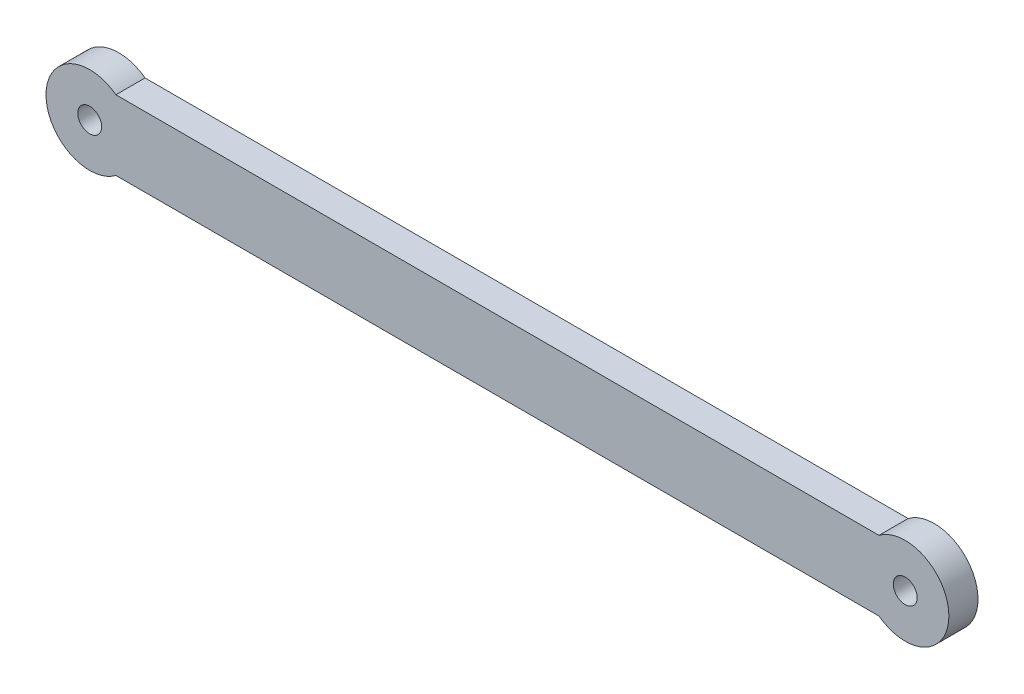
ISO-10303-21;
HEADER;
FILE_DESCRIPTION(('STEP AP214'),'2;1');
FILE_NAME('part.step','',(''),(''),'','','');
FILE_SCHEMA(('AUTOMOTIVE_DESIGN { 1 0 10303 214 1 1 1 1 }'));
ENDSEC;
DATA;
#1=APPLICATION_CONTEXT('core data for automotive mechanical design processes');
#2=APPLICATION_PROTOCOL_DEFINITION('international standard','automotive_design',2000,#1);
#3=PRODUCT_CONTEXT('',#1,'mechanical');
#4=PRODUCT('Part','Part','',(#3));
#5=PRODUCT_RELATED_PRODUCT_CATEGORY('part','',(#4));
#6=PRODUCT_DEFINITION_FORMATION('','',#4);
#7=PRODUCT_DEFINITION_CONTEXT('part definition',#1,'design');
#8=PRODUCT_DEFINITION('design','',#6,#7);
#9=PRODUCT_DEFINITION_SHAPE('','',#8);
#10=(LENGTH_UNIT() NAMED_UNIT(*) SI_UNIT(.MILLI.,.METRE.));
#11=(NAMED_UNIT(*) PLANE_ANGLE_UNIT() SI_UNIT($,.RADIAN.));
#12=(NAMED_UNIT(*) SI_UNIT($,.STERADIAN.) SOLID_ANGLE_UNIT());
#13=UNCERTAINTY_MEASURE_WITH_UNIT(LENGTH_MEASURE(1.E-05),#10,'distance_accuracy_value','');
#14=(GEOMETRIC_REPRESENTATION_CONTEXT(3) GLOBAL_UNCERTAINTY_ASSIGNED_CONTEXT((#13)) GLOBAL_UNIT_ASSIGNED_CONTEXT((#10,
#11,#12)) REPRESENTATION_CONTEXT('',''));
#15=CARTESIAN_POINT('',(0.,0.,0.));
#16=DIRECTION('',(0.,0.,1.));
#17=DIRECTION('',(1.,0.,0.));
#18=AXIS2_PLACEMENT_3D('',#15,#16,#17);
#19=CARTESIAN_POINT('',(0.,0.,5.));
#20=DIRECTION('',(0.,0.,1.));
#21=DIRECTION('',(1.,0.,0.));
#22=AXIS2_PLACEMENT_3D('',#19,#20,#21);
#23=PLANE('',#22);
#24=CARTESIAN_POINT('',(0.,0.,5.));
#25=DIRECTION('',(0.,0.,1.));
#26=DIRECTION('',(1.,0.,0.));
#27=AXIS2_PLACEMENT_3D('',#24,#25,#26);
#28=CIRCLE('',#27,2.05);
#29=CARTESIAN_POINT('',(2.05,0.,5.));
#30=VERTEX_POINT('',#29);
#31=EDGE_CURVE('E103',#30,#30,#28,.T.);
#32=ORIENTED_EDGE('',*,*,#31,.F.);
#33=EDGE_LOOP('',(#32));
#34=FACE_BOUND('',#33,.T.);
#35=CARTESIAN_POINT('',(0.,0.,5.));
#36=DIRECTION('',(0.,0.,1.));
#37=DIRECTION('',(1.,0.,0.));
#38=AXIS2_PLACEMENT_3D('',#35,#36,#37);
#39=CIRCLE('',#38,7.5);
#40=CARTESIAN_POINT('',(4.5,6.,5.));
#41=VERTEX_POINT('',#40);
#42=CARTESIAN_POINT('',(4.5,-6.,5.));
#43=VERTEX_POINT('',#42);
#44=EDGE_CURVE('E88',#41,#43,#39,.T.);
#45=ORIENTED_EDGE('',*,*,#44,.T.);
#46=DIRECTION('',(1.,0.,0.));
#47=VECTOR('',#46,1.);
#48=CARTESIAN_POINT('',(4.5,-6.,5.));
#49=LINE('',#48,#47);
#50=CARTESIAN_POINT('',(135.5,-6.,5.));
#51=VERTEX_POINT('',#50);
#52=EDGE_CURVE('E83',#43,#51,#49,.T.);
#53=ORIENTED_EDGE('',*,*,#52,.T.);
#54=CARTESIAN_POINT('',(140.,0.,5.));
#55=DIRECTION('',(0.,0.,1.));
#56=DIRECTION('',(1.,0.,0.));
#57=AXIS2_PLACEMENT_3D('',#54,#55,#56);
#58=CIRCLE('',#57,7.5);
#59=CARTESIAN_POINT('',(135.5,6.,5.));
#60=VERTEX_POINT('',#59);
#61=EDGE_CURVE('E86',#51,#60,#58,.T.);
#62=ORIENTED_EDGE('',*,*,#61,.T.);
#63=DIRECTION('',(-1.,0.,0.));
#64=VECTOR('',#63,1.);
#65=CARTESIAN_POINT('',(4.5,6.,5.));
#66=LINE('',#65,#64);
#67=EDGE_CURVE('E53',#60,#41,#66,.T.);
#68=ORIENTED_EDGE('',*,*,#67,.T.);
#69=EDGE_LOOP('',(#45,#53,#62,#68));
#70=FACE_BOUND('',#69,.T.);
#71=CARTESIAN_POINT('',(140.,0.,5.));
#72=DIRECTION('',(0.,0.,1.));
#73=DIRECTION('',(1.,0.,0.));
#74=AXIS2_PLACEMENT_3D('',#71,#72,#73);
#75=CIRCLE('',#74,2.04999999999999);
#76=CARTESIAN_POINT('',(142.05,0.,5.));
#77=VERTEX_POINT('',#76);
#78=EDGE_CURVE('E118',#77,#77,#75,.T.);
#79=ORIENTED_EDGE('',*,*,#78,.F.);
#80=EDGE_LOOP('',(#79));
#81=FACE_BOUND('',#80,.T.);
#82=ADVANCED_FACE('F36',(#34,#70,#81),#23,.T.);
#83=CARTESIAN_POINT('',(0.,0.,0.));
#84=DIRECTION('',(0.,0.,1.));
#85=DIRECTION('',(1.,0.,0.));
#86=AXIS2_PLACEMENT_3D('',#83,#84,#85);
#87=PLANE('',#86);
#88=CARTESIAN_POINT('',(0.,0.,0.));
#89=DIRECTION('',(0.,0.,1.));
#90=DIRECTION('',(1.,0.,0.));
#91=AXIS2_PLACEMENT_3D('',#88,#89,#90);
#92=CIRCLE('',#91,7.5);
#93=CARTESIAN_POINT('',(4.5,6.,0.));
#94=VERTEX_POINT('',#93);
#95=CARTESIAN_POINT('',(4.5,-6.,0.));
#96=VERTEX_POINT('',#95);
#97=EDGE_CURVE('E100',#94,#96,#92,.T.);
#98=ORIENTED_EDGE('',*,*,#97,.F.);
#99=DIRECTION('',(-1.,0.,0.));
#100=VECTOR('',#99,1.);
#101=CARTESIAN_POINT('',(4.5,6.,0.));
#102=LINE('',#101,#100);
#103=CARTESIAN_POINT('',(135.5,6.,0.));
#104=VERTEX_POINT('',#103);
#105=EDGE_CURVE('E76',#104,#94,#102,.T.);
#106=ORIENTED_EDGE('',*,*,#105,.F.);
#107=CARTESIAN_POINT('',(140.,0.,0.));
#108=DIRECTION('',(0.,0.,1.));
#109=DIRECTION('',(1.,0.,0.));
#110=AXIS2_PLACEMENT_3D('',#107,#108,#109);
#111=CIRCLE('',#110,7.5);
#112=CARTESIAN_POINT('',(135.5,-6.,0.));
#113=VERTEX_POINT('',#112);
#114=EDGE_CURVE('E70',#113,#104,#111,.T.);
#115=ORIENTED_EDGE('',*,*,#114,.F.);
#116=DIRECTION('',(1.,0.,0.));
#117=VECTOR('',#116,1.);
#118=CARTESIAN_POINT('',(4.5,-6.,0.));
#119=LINE('',#118,#117);
#120=EDGE_CURVE('E92',#96,#113,#119,.T.);
#121=ORIENTED_EDGE('',*,*,#120,.F.);
#122=EDGE_LOOP('',(#98,#106,#115,#121));
#123=FACE_BOUND('',#122,.T.);
#124=CARTESIAN_POINT('',(0.,0.,0.));
#125=DIRECTION('',(0.,0.,1.));
#126=DIRECTION('',(1.,0.,0.));
#127=AXIS2_PLACEMENT_3D('',#124,#125,#126);
#128=CIRCLE('',#127,2.05);
#129=CARTESIAN_POINT('',(2.05,0.,0.));
#130=VERTEX_POINT('',#129);
#131=EDGE_CURVE('E115',#130,#130,#128,.T.);
#132=ORIENTED_EDGE('',*,*,#131,.T.);
#133=EDGE_LOOP('',(#132));
#134=FACE_BOUND('',#133,.T.);
#135=CARTESIAN_POINT('',(140.,0.,0.));
#136=DIRECTION('',(0.,0.,1.));
#137=DIRECTION('',(1.,0.,0.));
#138=AXIS2_PLACEMENT_3D('',#135,#136,#137);
#139=CIRCLE('',#138,2.04999999999999);
#140=CARTESIAN_POINT('',(142.05,0.,0.));
#141=VERTEX_POINT('',#140);
#142=EDGE_CURVE('E121',#141,#141,#139,.T.);
#143=ORIENTED_EDGE('',*,*,#142,.T.);
#144=EDGE_LOOP('',(#143));
#145=FACE_BOUND('',#144,.T.);
#146=ADVANCED_FACE('F111',(#123,#134,#145),#87,.F.);
#147=CARTESIAN_POINT('',(0.,0.,5.));
#148=DIRECTION('',(0.,0.,-1.));
#149=DIRECTION('',(-1.,0.,0.));
#150=AXIS2_PLACEMENT_3D('',#147,#148,#149);
#151=CYLINDRICAL_SURFACE('',#150,7.5);
#152=ORIENTED_EDGE('',*,*,#97,.T.);
#153=DIRECTION('',(0.,0.,-1.));
#154=VECTOR('',#153,1.);
#155=CARTESIAN_POINT('',(4.5,-6.,5.));
#156=LINE('',#155,#154);
#157=EDGE_CURVE('E11',#43,#96,#156,.T.);
#158=ORIENTED_EDGE('',*,*,#157,.F.);
#159=ORIENTED_EDGE('',*,*,#44,.F.);
#160=DIRECTION('',(0.,0.,-1.));
#161=VECTOR('',#160,1.);
#162=CARTESIAN_POINT('',(4.5,6.,5.));
#163=LINE('',#162,#161);
#164=EDGE_CURVE('E96',#41,#94,#163,.T.);
#165=ORIENTED_EDGE('',*,*,#164,.T.);
#166=EDGE_LOOP('',(#152,#158,#159,#165));
#167=FACE_BOUND('',#166,.T.);
#168=ADVANCED_FACE('F38',(#167),#151,.T.);
#169=CARTESIAN_POINT('',(4.5,-6.,5.));
#170=DIRECTION('',(0.,1.,0.));
#171=DIRECTION('',(0.,0.,1.));
#172=AXIS2_PLACEMENT_3D('',#169,#170,#171);
#173=PLANE('',#172);
#174=ORIENTED_EDGE('',*,*,#120,.T.);
#175=DIRECTION('',(0.,0.,-1.));
#176=VECTOR('',#175,1.);
#177=CARTESIAN_POINT('',(135.5,-6.,5.));
#178=LINE('',#177,#176);
#179=EDGE_CURVE('E45',#51,#113,#178,.T.);
#180=ORIENTED_EDGE('',*,*,#179,.F.);
#181=ORIENTED_EDGE('',*,*,#52,.F.);
#182=ORIENTED_EDGE('',*,*,#157,.T.);
#183=EDGE_LOOP('',(#174,#180,#181,#182));
#184=FACE_BOUND('',#183,.T.);
#185=ADVANCED_FACE('F91',(#184),#173,.F.);
#186=CARTESIAN_POINT('',(140.,0.,5.));
#187=DIRECTION('',(0.,0.,-1.));
#188=DIRECTION('',(-1.,0.,0.));
#189=AXIS2_PLACEMENT_3D('',#186,#187,#188);
#190=CYLINDRICAL_SURFACE('',#189,7.5);
#191=ORIENTED_EDGE('',*,*,#114,.T.);
#192=DIRECTION('',(0.,0.,-1.));
#193=VECTOR('',#192,1.);
#194=CARTESIAN_POINT('',(135.5,6.,5.));
#195=LINE('',#194,#193);
#196=EDGE_CURVE('E93',#60,#104,#195,.T.);
#197=ORIENTED_EDGE('',*,*,#196,.F.);
#198=ORIENTED_EDGE('',*,*,#61,.F.);
#199=ORIENTED_EDGE('',*,*,#179,.T.);
#200=EDGE_LOOP('',(#191,#197,#198,#199));
#201=FACE_BOUND('',#200,.T.);
#202=ADVANCED_FACE('F94',(#201),#190,.T.);
#203=CARTESIAN_POINT('',(4.5,6.,5.));
#204=DIRECTION('',(0.,-1.,0.));
#205=DIRECTION('',(0.,0.,-1.));
#206=AXIS2_PLACEMENT_3D('',#203,#204,#205);
#207=PLANE('',#206);
#208=ORIENTED_EDGE('',*,*,#105,.T.);
#209=ORIENTED_EDGE('',*,*,#164,.F.);
#210=ORIENTED_EDGE('',*,*,#67,.F.);
#211=ORIENTED_EDGE('',*,*,#196,.T.);
#212=EDGE_LOOP('',(#208,#209,#210,#211));
#213=FACE_BOUND('',#212,.T.);
#214=ADVANCED_FACE('F108',(#213),#207,.F.);
#215=CARTESIAN_POINT('',(0.,0.,5.));
#216=DIRECTION('',(0.,0.,-1.));
#217=DIRECTION('',(-1.,0.,0.));
#218=AXIS2_PLACEMENT_3D('',#215,#216,#217);
#219=CYLINDRICAL_SURFACE('',#218,2.05);
#220=ORIENTED_EDGE('',*,*,#31,.T.);
#221=EDGE_LOOP('',(#220));
#222=FACE_BOUND('',#221,.T.);
#223=ORIENTED_EDGE('',*,*,#131,.F.);
#224=EDGE_LOOP('',(#223));
#225=FACE_BOUND('',#224,.T.);
#226=ADVANCED_FACE('F138',(#222,#225),#219,.F.);
#227=CARTESIAN_POINT('',(140.,0.,5.));
#228=DIRECTION('',(0.,0.,-1.));
#229=DIRECTION('',(-1.,0.,0.));
#230=AXIS2_PLACEMENT_3D('',#227,#228,#229);
#231=CYLINDRICAL_SURFACE('',#230,2.04999999999999);
#232=ORIENTED_EDGE('',*,*,#78,.T.);
#233=EDGE_LOOP('',(#232));
#234=FACE_BOUND('',#233,.T.);
#235=ORIENTED_EDGE('',*,*,#142,.F.);
#236=EDGE_LOOP('',(#235));
#237=FACE_BOUND('',#236,.T.);
#238=ADVANCED_FACE('F127',(#234,#237),#231,.F.);
#239=CLOSED_SHELL('',(#82,#146,#168,#185,#202,#214,#226,#238));
#240=MANIFOLD_SOLID_BREP('B2',#239);
#241=ADVANCED_BREP_SHAPE_REPRESENTATION('',(#18,#240),#14);
#242=SHAPE_DEFINITION_REPRESENTATION(#9,#241);
ENDSEC;
END-ISO-10303-21;
